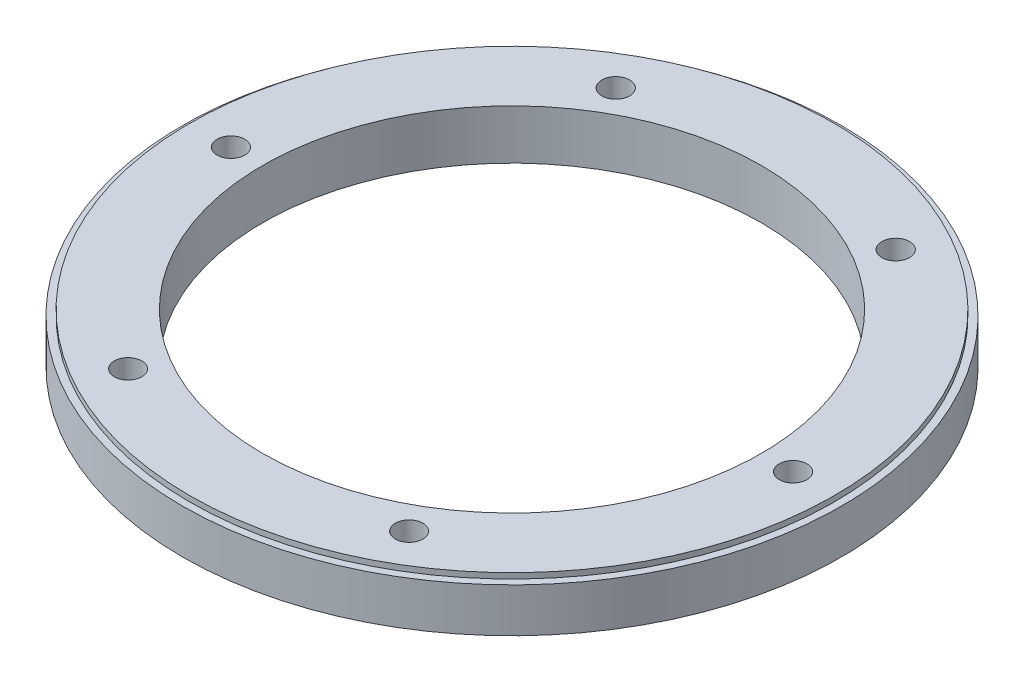
ISO-10303-21;
HEADER;
FILE_DESCRIPTION(('STEP AP214'),'2;1');
FILE_NAME('part.step','',(''),(''),'','','');
FILE_SCHEMA(('AUTOMOTIVE_DESIGN { 1 0 10303 214 1 1 1 1 }'));
ENDSEC;
DATA;
#1=APPLICATION_CONTEXT('core data for automotive mechanical design processes');
#2=APPLICATION_PROTOCOL_DEFINITION('international standard','automotive_design',2000,#1);
#3=PRODUCT_CONTEXT('',#1,'mechanical');
#4=PRODUCT('Part','Part','',(#3));
#5=PRODUCT_RELATED_PRODUCT_CATEGORY('part','',(#4));
#6=PRODUCT_DEFINITION_FORMATION('','',#4);
#7=PRODUCT_DEFINITION_CONTEXT('part definition',#1,'design');
#8=PRODUCT_DEFINITION('design','',#6,#7);
#9=PRODUCT_DEFINITION_SHAPE('','',#8);
#10=(LENGTH_UNIT() NAMED_UNIT(*) SI_UNIT(.MILLI.,.METRE.));
#11=(NAMED_UNIT(*) PLANE_ANGLE_UNIT() SI_UNIT($,.RADIAN.));
#12=(NAMED_UNIT(*) SI_UNIT($,.STERADIAN.) SOLID_ANGLE_UNIT());
#13=UNCERTAINTY_MEASURE_WITH_UNIT(LENGTH_MEASURE(1.E-05),#10,'distance_accuracy_value','');
#14=(GEOMETRIC_REPRESENTATION_CONTEXT(3) GLOBAL_UNCERTAINTY_ASSIGNED_CONTEXT((#13)) GLOBAL_UNIT_ASSIGNED_CONTEXT((#10,
#11,#12)) REPRESENTATION_CONTEXT('',''));
#15=CARTESIAN_POINT('',(0.,0.,0.));
#16=DIRECTION('',(0.,0.,1.));
#17=DIRECTION('',(1.,0.,0.));
#18=AXIS2_PLACEMENT_3D('',#15,#16,#17);
#19=CARTESIAN_POINT('',(0.,10.16,0.));
#20=DIRECTION('',(0.,-1.,0.));
#21=DIRECTION('',(0.,0.,-1.));
#22=AXIS2_PLACEMENT_3D('',#19,#20,#21);
#23=CYLINDRICAL_SURFACE('',#22,75.946);
#24=CARTESIAN_POINT('',(0.,10.16,0.));
#25=DIRECTION('',(0.,1.,0.));
#26=DIRECTION('',(0.,0.,1.));
#27=AXIS2_PLACEMENT_3D('',#24,#25,#26);
#28=CIRCLE('',#27,75.946);
#29=CARTESIAN_POINT('',(0.,10.16,75.946));
#30=VERTEX_POINT('',#29);
#31=EDGE_CURVE('E45',#30,#30,#28,.T.);
#32=ORIENTED_EDGE('',*,*,#31,.F.);
#33=EDGE_LOOP('',(#32));
#34=FACE_BOUND('',#33,.T.);
#35=CARTESIAN_POINT('',(0.,0.,0.));
#36=DIRECTION('',(0.,1.,0.));
#37=DIRECTION('',(0.,0.,1.));
#38=AXIS2_PLACEMENT_3D('',#35,#36,#37);
#39=CIRCLE('',#38,75.946);
#40=CARTESIAN_POINT('',(0.,0.,75.946));
#41=VERTEX_POINT('',#40);
#42=EDGE_CURVE('E41',#41,#41,#39,.T.);
#43=ORIENTED_EDGE('',*,*,#42,.T.);
#44=EDGE_LOOP('',(#43));
#45=FACE_BOUND('',#44,.T.);
#46=ADVANCED_FACE('F38',(#34,#45),#23,.T.);
#47=CARTESIAN_POINT('',(0.,10.16,0.));
#48=DIRECTION('',(0.,1.,0.));
#49=DIRECTION('',(0.,0.,1.));
#50=AXIS2_PLACEMENT_3D('',#47,#48,#49);
#51=PLANE('',#50);
#52=CARTESIAN_POINT('',(0.,10.16,0.));
#53=DIRECTION('',(0.,1.,0.));
#54=DIRECTION('',(0.,0.,1.));
#55=AXIS2_PLACEMENT_3D('',#52,#53,#54);
#56=CIRCLE('',#55,74.295);
#57=CARTESIAN_POINT('',(0.,10.16,74.295));
#58=VERTEX_POINT('',#57);
#59=EDGE_CURVE('E10',#58,#58,#56,.T.);
#60=ORIENTED_EDGE('',*,*,#59,.F.);
#61=EDGE_LOOP('',(#60));
#62=FACE_BOUND('',#61,.T.);
#63=ORIENTED_EDGE('',*,*,#31,.T.);
#64=EDGE_LOOP('',(#63));
#65=FACE_BOUND('',#64,.T.);
#66=ADVANCED_FACE('F134',(#62,#65),#51,.T.);
#67=CARTESIAN_POINT('',(0.,0.,0.));
#68=DIRECTION('',(0.,1.,0.));
#69=DIRECTION('',(0.,0.,1.));
#70=AXIS2_PLACEMENT_3D('',#67,#68,#69);
#71=PLANE('',#70);
#72=CARTESIAN_POINT('',(0.,0.,0.));
#73=DIRECTION('',(0.,1.,0.));
#74=DIRECTION('',(0.,0.,1.));
#75=AXIS2_PLACEMENT_3D('',#72,#73,#74);
#76=CIRCLE('',#75,57.4675);
#77=CARTESIAN_POINT('',(0.,0.,57.4675));
#78=VERTEX_POINT('',#77);
#79=EDGE_CURVE('E86',#78,#78,#76,.T.);
#80=ORIENTED_EDGE('',*,*,#79,.T.);
#81=EDGE_LOOP('',(#80));
#82=FACE_BOUND('',#81,.T.);
#83=CARTESIAN_POINT('',(-64.77,0.,0.));
#84=DIRECTION('',(0.,1.,0.));
#85=DIRECTION('',(0.,0.,1.));
#86=AXIS2_PLACEMENT_3D('',#83,#84,#85);
#87=CIRCLE('',#86,3.18347823414576);
#88=CARTESIAN_POINT('',(-64.77,0.,3.18347823414576));
#89=VERTEX_POINT('',#88);
#90=EDGE_CURVE('E54',#89,#89,#87,.T.);
#91=ORIENTED_EDGE('',*,*,#90,.T.);
#92=EDGE_LOOP('',(#91));
#93=FACE_BOUND('',#92,.T.);
#94=CARTESIAN_POINT('',(32.2604784147299,0.,-56.1641739229978));
#95=DIRECTION('',(0.,1.,0.));
#96=DIRECTION('',(0.,0.,-1.));
#97=AXIS2_PLACEMENT_3D('',#94,#95,#96);
#98=CIRCLE('',#97,3.2);
#99=CARTESIAN_POINT('',(32.2604784147299,0.,-59.3641739229978));
#100=VERTEX_POINT('',#99);
#101=EDGE_CURVE('E83',#100,#100,#98,.T.);
#102=ORIENTED_EDGE('',*,*,#101,.T.);
#103=EDGE_LOOP('',(#102));
#104=FACE_BOUND('',#103,.T.);
#105=CARTESIAN_POINT('',(64.77,0.,0.));
#106=DIRECTION('',(0.,1.,0.));
#107=DIRECTION('',(0.,0.,-1.));
#108=AXIS2_PLACEMENT_3D('',#105,#106,#107);
#109=CIRCLE('',#108,3.18347823414576);
#110=CARTESIAN_POINT('',(64.77,0.,-3.18347823414577));
#111=VERTEX_POINT('',#110);
#112=EDGE_CURVE('E59',#111,#111,#109,.T.);
#113=ORIENTED_EDGE('',*,*,#112,.T.);
#114=EDGE_LOOP('',(#113));
#115=FACE_BOUND('',#114,.T.);
#116=CARTESIAN_POINT('',(32.385,0.,56.0924654031181));
#117=DIRECTION('',(0.,1.,0.));
#118=DIRECTION('',(0.,0.,-1.));
#119=AXIS2_PLACEMENT_3D('',#116,#117,#118);
#120=CIRCLE('',#119,3.175);
#121=CARTESIAN_POINT('',(32.385,0.,52.9174654031181));
#122=VERTEX_POINT('',#121);
#123=EDGE_CURVE('E58',#122,#122,#120,.T.);
#124=ORIENTED_EDGE('',*,*,#123,.T.);
#125=EDGE_LOOP('',(#124));
#126=FACE_BOUND('',#125,.T.);
#127=CARTESIAN_POINT('',(-32.385,0.,56.0924654031181));
#128=DIRECTION('',(0.,1.,0.));
#129=DIRECTION('',(0.,0.,1.));
#130=AXIS2_PLACEMENT_3D('',#127,#128,#129);
#131=CIRCLE('',#130,3.175);
#132=CARTESIAN_POINT('',(-32.385,0.,59.2674654031181));
#133=VERTEX_POINT('',#132);
#134=EDGE_CURVE('E66',#133,#133,#131,.T.);
#135=ORIENTED_EDGE('',*,*,#134,.T.);
#136=EDGE_LOOP('',(#135));
#137=FACE_BOUND('',#136,.T.);
#138=CARTESIAN_POINT('',(-32.2604784147299,0.,-56.1641739229978));
#139=DIRECTION('',(0.,1.,0.));
#140=DIRECTION('',(0.,0.,1.));
#141=AXIS2_PLACEMENT_3D('',#138,#139,#140);
#142=CIRCLE('',#141,3.2);
#143=CARTESIAN_POINT('',(-32.2604784147299,0.,-52.9641739229978));
#144=VERTEX_POINT('',#143);
#145=EDGE_CURVE('E72',#144,#144,#142,.T.);
#146=ORIENTED_EDGE('',*,*,#145,.T.);
#147=EDGE_LOOP('',(#146));
#148=FACE_BOUND('',#147,.T.);
#149=ORIENTED_EDGE('',*,*,#42,.F.);
#150=EDGE_LOOP('',(#149));
#151=FACE_BOUND('',#150,.T.);
#152=ADVANCED_FACE('F97',(#82,#93,#104,#115,#126,#137,#148,#151),#71,.F.);
#153=CARTESIAN_POINT('',(0.,11.43,0.));
#154=DIRECTION('',(0.,-1.,0.));
#155=DIRECTION('',(0.,0.,-1.));
#156=AXIS2_PLACEMENT_3D('',#153,#154,#155);
#157=CYLINDRICAL_SURFACE('',#156,74.295);
#158=CARTESIAN_POINT('',(0.,11.43,0.));
#159=DIRECTION('',(0.,1.,0.));
#160=DIRECTION('',(0.,0.,1.));
#161=AXIS2_PLACEMENT_3D('',#158,#159,#160);
#162=CIRCLE('',#161,74.295);
#163=CARTESIAN_POINT('',(0.,11.43,74.295));
#164=VERTEX_POINT('',#163);
#165=EDGE_CURVE('E51',#164,#164,#162,.T.);
#166=ORIENTED_EDGE('',*,*,#165,.F.);
#167=EDGE_LOOP('',(#166));
#168=FACE_BOUND('',#167,.T.);
#169=ORIENTED_EDGE('',*,*,#59,.T.);
#170=EDGE_LOOP('',(#169));
#171=FACE_BOUND('',#170,.T.);
#172=ADVANCED_FACE('F111',(#168,#171),#157,.T.);
#173=CARTESIAN_POINT('',(0.,11.43,0.));
#174=DIRECTION('',(0.,1.,0.));
#175=DIRECTION('',(0.,0.,1.));
#176=AXIS2_PLACEMENT_3D('',#173,#174,#175);
#177=PLANE('',#176);
#178=CARTESIAN_POINT('',(0.,11.43,0.));
#179=DIRECTION('',(0.,1.,0.));
#180=DIRECTION('',(0.,0.,1.));
#181=AXIS2_PLACEMENT_3D('',#178,#179,#180);
#182=CIRCLE('',#181,57.4675);
#183=CARTESIAN_POINT('',(0.,11.43,57.4675));
#184=VERTEX_POINT('',#183);
#185=EDGE_CURVE('E91',#184,#184,#182,.T.);
#186=ORIENTED_EDGE('',*,*,#185,.F.);
#187=EDGE_LOOP('',(#186));
#188=FACE_BOUND('',#187,.T.);
#189=CARTESIAN_POINT('',(-64.77,11.43,0.));
#190=DIRECTION('',(0.,1.,0.));
#191=DIRECTION('',(0.,0.,1.));
#192=AXIS2_PLACEMENT_3D('',#189,#190,#191);
#193=CIRCLE('',#192,3.18347823414576);
#194=CARTESIAN_POINT('',(-64.77,11.43,3.18347823414576));
#195=VERTEX_POINT('',#194);
#196=EDGE_CURVE('E78',#195,#195,#193,.T.);
#197=ORIENTED_EDGE('',*,*,#196,.F.);
#198=EDGE_LOOP('',(#197));
#199=FACE_BOUND('',#198,.T.);
#200=CARTESIAN_POINT('',(32.2604784147299,11.43,-56.1641739229978));
#201=DIRECTION('',(0.,1.,0.));
#202=DIRECTION('',(0.,0.,-1.));
#203=AXIS2_PLACEMENT_3D('',#200,#201,#202);
#204=CIRCLE('',#203,3.2);
#205=CARTESIAN_POINT('',(32.2604784147299,11.43,-59.3641739229978));
#206=VERTEX_POINT('',#205);
#207=EDGE_CURVE('E62',#206,#206,#204,.T.);
#208=ORIENTED_EDGE('',*,*,#207,.F.);
#209=EDGE_LOOP('',(#208));
#210=FACE_BOUND('',#209,.T.);
#211=CARTESIAN_POINT('',(64.77,11.43,0.));
#212=DIRECTION('',(0.,1.,0.));
#213=DIRECTION('',(0.,0.,-1.));
#214=AXIS2_PLACEMENT_3D('',#211,#212,#213);
#215=CIRCLE('',#214,3.18347823414576);
#216=CARTESIAN_POINT('',(64.77,11.43,-3.18347823414577));
#217=VERTEX_POINT('',#216);
#218=EDGE_CURVE('E55',#217,#217,#215,.T.);
#219=ORIENTED_EDGE('',*,*,#218,.F.);
#220=EDGE_LOOP('',(#219));
#221=FACE_BOUND('',#220,.T.);
#222=CARTESIAN_POINT('',(32.385,11.43,56.0924654031181));
#223=DIRECTION('',(0.,1.,0.));
#224=DIRECTION('',(0.,0.,-1.));
#225=AXIS2_PLACEMENT_3D('',#222,#223,#224);
#226=CIRCLE('',#225,3.175);
#227=CARTESIAN_POINT('',(32.385,11.43,52.9174654031181));
#228=VERTEX_POINT('',#227);
#229=EDGE_CURVE('E63',#228,#228,#226,.T.);
#230=ORIENTED_EDGE('',*,*,#229,.F.);
#231=EDGE_LOOP('',(#230));
#232=FACE_BOUND('',#231,.T.);
#233=CARTESIAN_POINT('',(-32.385,11.43,56.0924654031181));
#234=DIRECTION('',(0.,1.,0.));
#235=DIRECTION('',(0.,0.,1.));
#236=AXIS2_PLACEMENT_3D('',#233,#234,#235);
#237=CIRCLE('',#236,3.175);
#238=CARTESIAN_POINT('',(-32.385,11.43,59.2674654031181));
#239=VERTEX_POINT('',#238);
#240=EDGE_CURVE('E69',#239,#239,#237,.T.);
#241=ORIENTED_EDGE('',*,*,#240,.F.);
#242=EDGE_LOOP('',(#241));
#243=FACE_BOUND('',#242,.T.);
#244=CARTESIAN_POINT('',(-32.2604784147299,11.43,-56.1641739229978));
#245=DIRECTION('',(0.,1.,0.));
#246=DIRECTION('',(0.,0.,1.));
#247=AXIS2_PLACEMENT_3D('',#244,#245,#246);
#248=CIRCLE('',#247,3.2);
#249=CARTESIAN_POINT('',(-32.2604784147299,11.43,-52.9641739229978));
#250=VERTEX_POINT('',#249);
#251=EDGE_CURVE('E75',#250,#250,#248,.T.);
#252=ORIENTED_EDGE('',*,*,#251,.F.);
#253=EDGE_LOOP('',(#252));
#254=FACE_BOUND('',#253,.T.);
#255=ORIENTED_EDGE('',*,*,#165,.T.);
#256=EDGE_LOOP('',(#255));
#257=FACE_BOUND('',#256,.T.);
#258=ADVANCED_FACE('F107',(#188,#199,#210,#221,#232,#243,#254,#257),#177,.T.);
#259=CARTESIAN_POINT('',(-32.2604784147299,0.,-56.1641739229978));
#260=DIRECTION('',(0.,1.,0.));
#261=DIRECTION('',(0.,0.,1.));
#262=AXIS2_PLACEMENT_3D('',#259,#260,#261);
#263=CYLINDRICAL_SURFACE('',#262,3.2);
#264=ORIENTED_EDGE('',*,*,#145,.F.);
#265=EDGE_LOOP('',(#264));
#266=FACE_BOUND('',#265,.T.);
#267=ORIENTED_EDGE('',*,*,#251,.T.);
#268=EDGE_LOOP('',(#267));
#269=FACE_BOUND('',#268,.T.);
#270=ADVANCED_FACE('F110',(#266,#269),#263,.F.);
#271=CARTESIAN_POINT('',(-32.385,0.,56.0924654031181));
#272=DIRECTION('',(0.,1.,0.));
#273=DIRECTION('',(0.,0.,1.));
#274=AXIS2_PLACEMENT_3D('',#271,#272,#273);
#275=CYLINDRICAL_SURFACE('',#274,3.175);
#276=ORIENTED_EDGE('',*,*,#134,.F.);
#277=EDGE_LOOP('',(#276));
#278=FACE_BOUND('',#277,.T.);
#279=ORIENTED_EDGE('',*,*,#240,.T.);
#280=EDGE_LOOP('',(#279));
#281=FACE_BOUND('',#280,.T.);
#282=ADVANCED_FACE('F178',(#278,#281),#275,.F.);
#283=CARTESIAN_POINT('',(32.385,0.,56.0924654031181));
#284=DIRECTION('',(0.,1.,0.));
#285=DIRECTION('',(0.,0.,1.));
#286=AXIS2_PLACEMENT_3D('',#283,#284,#285);
#287=CYLINDRICAL_SURFACE('',#286,3.175);
#288=ORIENTED_EDGE('',*,*,#123,.F.);
#289=EDGE_LOOP('',(#288));
#290=FACE_BOUND('',#289,.T.);
#291=ORIENTED_EDGE('',*,*,#229,.T.);
#292=EDGE_LOOP('',(#291));
#293=FACE_BOUND('',#292,.T.);
#294=ADVANCED_FACE('F188',(#290,#293),#287,.F.);
#295=CARTESIAN_POINT('',(64.77,0.,0.));
#296=DIRECTION('',(0.,1.,0.));
#297=DIRECTION('',(0.,0.,1.));
#298=AXIS2_PLACEMENT_3D('',#295,#296,#297);
#299=CYLINDRICAL_SURFACE('',#298,3.18347823414576);
#300=ORIENTED_EDGE('',*,*,#112,.F.);
#301=EDGE_LOOP('',(#300));
#302=FACE_BOUND('',#301,.T.);
#303=ORIENTED_EDGE('',*,*,#218,.T.);
#304=EDGE_LOOP('',(#303));
#305=FACE_BOUND('',#304,.T.);
#306=ADVANCED_FACE('F198',(#302,#305),#299,.F.);
#307=CARTESIAN_POINT('',(32.2604784147299,0.,-56.1641739229978));
#308=DIRECTION('',(0.,1.,0.));
#309=DIRECTION('',(0.,0.,1.));
#310=AXIS2_PLACEMENT_3D('',#307,#308,#309);
#311=CYLINDRICAL_SURFACE('',#310,3.2);
#312=ORIENTED_EDGE('',*,*,#101,.F.);
#313=EDGE_LOOP('',(#312));
#314=FACE_BOUND('',#313,.T.);
#315=ORIENTED_EDGE('',*,*,#207,.T.);
#316=EDGE_LOOP('',(#315));
#317=FACE_BOUND('',#316,.T.);
#318=ADVANCED_FACE('F208',(#314,#317),#311,.F.);
#319=CARTESIAN_POINT('',(-64.77,0.,0.));
#320=DIRECTION('',(0.,1.,0.));
#321=DIRECTION('',(0.,0.,1.));
#322=AXIS2_PLACEMENT_3D('',#319,#320,#321);
#323=CYLINDRICAL_SURFACE('',#322,3.18347823414576);
#324=ORIENTED_EDGE('',*,*,#90,.F.);
#325=EDGE_LOOP('',(#324));
#326=FACE_BOUND('',#325,.T.);
#327=ORIENTED_EDGE('',*,*,#196,.T.);
#328=EDGE_LOOP('',(#327));
#329=FACE_BOUND('',#328,.T.);
#330=ADVANCED_FACE('F103',(#326,#329),#323,.F.);
#331=CARTESIAN_POINT('',(0.,0.,0.));
#332=DIRECTION('',(0.,1.,0.));
#333=DIRECTION('',(0.,0.,1.));
#334=AXIS2_PLACEMENT_3D('',#331,#332,#333);
#335=CYLINDRICAL_SURFACE('',#334,57.4675);
#336=ORIENTED_EDGE('',*,*,#79,.F.);
#337=EDGE_LOOP('',(#336));
#338=FACE_BOUND('',#337,.T.);
#339=ORIENTED_EDGE('',*,*,#185,.T.);
#340=EDGE_LOOP('',(#339));
#341=FACE_BOUND('',#340,.T.);
#342=ADVANCED_FACE('F100',(#338,#341),#335,.F.);
#343=CLOSED_SHELL('',(#46,#66,#152,#172,#258,#270,#282,#294,#306,#318,#330,#342));
#344=MANIFOLD_SOLID_BREP('B2',#343);
#345=ADVANCED_BREP_SHAPE_REPRESENTATION('',(#18,#344),#14);
#346=SHAPE_DEFINITION_REPRESENTATION(#9,#345);
ENDSEC;
END-ISO-10303-21;
